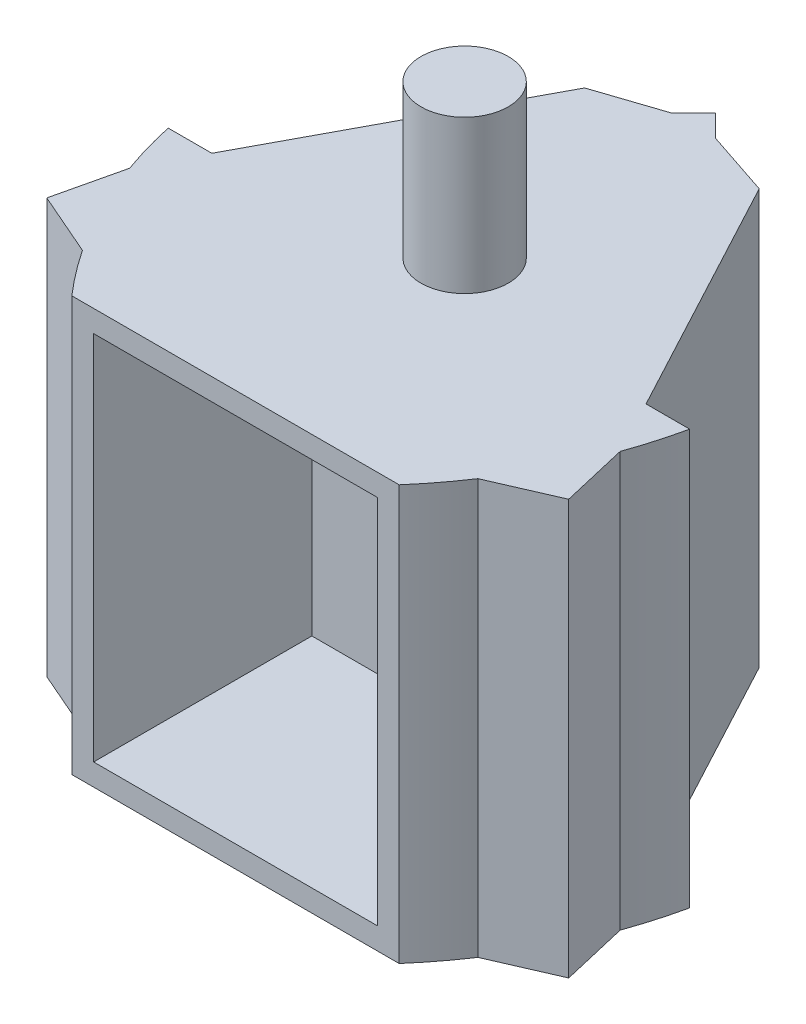
ISO-10303-21;
HEADER;
FILE_DESCRIPTION(('STEP AP214'),'2;1');
FILE_NAME('part.step','',(''),(''),'','','');
FILE_SCHEMA(('AUTOMOTIVE_DESIGN { 1 0 10303 214 1 1 1 1 }'));
ENDSEC;
DATA;
#1=APPLICATION_CONTEXT('core data for automotive mechanical design processes');
#2=APPLICATION_PROTOCOL_DEFINITION('international standard','automotive_design',2000,#1);
#3=PRODUCT_CONTEXT('',#1,'mechanical');
#4=PRODUCT('Part','Part','',(#3));
#5=PRODUCT_RELATED_PRODUCT_CATEGORY('part','',(#4));
#6=PRODUCT_DEFINITION_FORMATION('','',#4);
#7=PRODUCT_DEFINITION_CONTEXT('part definition',#1,'design');
#8=PRODUCT_DEFINITION('design','',#6,#7);
#9=PRODUCT_DEFINITION_SHAPE('','',#8);
#10=(LENGTH_UNIT() NAMED_UNIT(*) SI_UNIT(.MILLI.,.METRE.));
#11=(NAMED_UNIT(*) PLANE_ANGLE_UNIT() SI_UNIT($,.RADIAN.));
#12=(NAMED_UNIT(*) SI_UNIT($,.STERADIAN.) SOLID_ANGLE_UNIT());
#13=UNCERTAINTY_MEASURE_WITH_UNIT(LENGTH_MEASURE(1.E-05),#10,'distance_accuracy_value','');
#14=(GEOMETRIC_REPRESENTATION_CONTEXT(3) GLOBAL_UNCERTAINTY_ASSIGNED_CONTEXT((#13)) GLOBAL_UNIT_ASSIGNED_CONTEXT((#10,
#11,#12)) REPRESENTATION_CONTEXT('',''));
#15=CARTESIAN_POINT('',(0.,0.,0.));
#16=DIRECTION('',(0.,0.,1.));
#17=DIRECTION('',(1.,0.,0.));
#18=AXIS2_PLACEMENT_3D('',#15,#16,#17);
#19=CARTESIAN_POINT('',(-11.0697847980685,19.,12.8860125419096));
#20=DIRECTION('',(-0.973745378908467,0.,-0.227639928515201));
#21=DIRECTION('',(-0.227639928515201,0.,0.973745378908467));
#22=AXIS2_PLACEMENT_3D('',#19,#20,#21);
#23=PLANE('',#22);
#24=DIRECTION('',(0.227639928515201,0.,-0.973745378908467));
#25=VECTOR('',#24,1.);
#26=CARTESIAN_POINT('',(-11.0697847980685,19.,12.8860125419096));
#27=LINE('',#26,#25);
#28=CARTESIAN_POINT('',(-11.9587471370231,19.,16.6886098069273));
#29=VERTEX_POINT('',#28);
#30=CARTESIAN_POINT('',(-11.239303028901,19.,13.6111383798529));
#31=VERTEX_POINT('',#30);
#32=EDGE_CURVE('E246',#29,#31,#27,.T.);
#33=ORIENTED_EDGE('',*,*,#32,.T.);
#34=DIRECTION('',(0.,-1.,0.));
#35=VECTOR('',#34,1.);
#36=CARTESIAN_POINT('',(-11.239303028901,19.,13.6111383798529));
#37=LINE('',#36,#35);
#38=CARTESIAN_POINT('',(-11.239303028901,0.,13.6111383798529));
#39=VERTEX_POINT('',#38);
#40=EDGE_CURVE('E219',#31,#39,#37,.T.);
#41=ORIENTED_EDGE('',*,*,#40,.T.);
#42=DIRECTION('',(0.227639928515201,0.,-0.973745378908467));
#43=VECTOR('',#42,1.);
#44=CARTESIAN_POINT('',(-11.0697847980685,0.,12.8860125419096));
#45=LINE('',#44,#43);
#46=CARTESIAN_POINT('',(-11.9587471370231,0.,16.6886098069273));
#47=VERTEX_POINT('',#46);
#48=EDGE_CURVE('E247',#47,#39,#45,.T.);
#49=ORIENTED_EDGE('',*,*,#48,.F.);
#50=DIRECTION('',(0.,-1.,0.));
#51=VECTOR('',#50,1.);
#52=CARTESIAN_POINT('',(-11.9587471370231,19.,16.6886098069273));
#53=LINE('',#52,#51);
#54=EDGE_CURVE('E250',#29,#47,#53,.T.);
#55=ORIENTED_EDGE('',*,*,#54,.F.);
#56=EDGE_LOOP('',(#33,#41,#49,#55));
#57=FACE_BOUND('',#56,.T.);
#58=ADVANCED_FACE('F35',(#57),#23,.T.);
#59=CARTESIAN_POINT('',(-11.9587471370231,19.,16.6886098069273));
#60=DIRECTION('',(-0.399501555391885,0.,0.916732516735097));
#61=DIRECTION('',(0.916732516735097,0.,0.399501555391886));
#62=AXIS2_PLACEMENT_3D('',#59,#60,#61);
#63=PLANE('',#62);
#64=DIRECTION('',(-0.916732516735097,0.,-0.399501555391886));
#65=VECTOR('',#64,1.);
#66=CARTESIAN_POINT('',(-11.9587471370231,0.,16.6886098069273));
#67=LINE('',#66,#65);
#68=CARTESIAN_POINT('',(-9.06146188398829,0.,17.9512136132411));
#69=VERTEX_POINT('',#68);
#70=EDGE_CURVE('E243',#69,#47,#67,.T.);
#71=ORIENTED_EDGE('',*,*,#70,.F.);
#72=DIRECTION('',(0.,-1.,0.));
#73=VECTOR('',#72,1.);
#74=CARTESIAN_POINT('',(-9.06146188398829,19.,17.9512136132411));
#75=LINE('',#74,#73);
#76=CARTESIAN_POINT('',(-9.06146188398829,19.,17.9512136132411));
#77=VERTEX_POINT('',#76);
#78=EDGE_CURVE('E225',#77,#69,#75,.T.);
#79=ORIENTED_EDGE('',*,*,#78,.F.);
#80=DIRECTION('',(-0.916732516735097,0.,-0.399501555391886));
#81=VECTOR('',#80,1.);
#82=CARTESIAN_POINT('',(-11.9587471370231,19.,16.6886098069273));
#83=LINE('',#82,#81);
#84=EDGE_CURVE('E244',#77,#29,#83,.T.);
#85=ORIENTED_EDGE('',*,*,#84,.T.);
#86=ORIENTED_EDGE('',*,*,#54,.T.);
#87=EDGE_LOOP('',(#71,#79,#85,#86));
#88=FACE_BOUND('',#87,.T.);
#89=ADVANCED_FACE('F398',(#88),#63,.T.);
#90=CARTESIAN_POINT('',(0.,19.,11.1347257955987));
#91=DIRECTION('',(0.,0.,-1.));
#92=DIRECTION('',(-1.,0.,0.));
#93=AXIS2_PLACEMENT_3D('',#90,#91,#92);
#94=PLANE('',#93);
#95=DIRECTION('',(0.,-1.,0.));
#96=VECTOR('',#95,1.);
#97=CARTESIAN_POINT('',(9.94857701422973,19.,11.1347257955987));
#98=LINE('',#97,#96);
#99=CARTESIAN_POINT('',(9.94857701422973,19.,11.1347257955987));
#100=VERTEX_POINT('',#99);
#101=CARTESIAN_POINT('',(9.94857701422973,0.,11.1347257955987));
#102=VERTEX_POINT('',#101);
#103=EDGE_CURVE('E314',#100,#102,#98,.T.);
#104=ORIENTED_EDGE('',*,*,#103,.F.);
#105=DIRECTION('',(1.,0.,0.));
#106=VECTOR('',#105,1.);
#107=CARTESIAN_POINT('',(0.,19.,11.1347257955987));
#108=LINE('',#107,#106);
#109=CARTESIAN_POINT('',(11.9485770142297,19.,11.1347257955987));
#110=VERTEX_POINT('',#109);
#111=EDGE_CURVE('E328',#100,#110,#108,.T.);
#112=ORIENTED_EDGE('',*,*,#111,.T.);
#113=DIRECTION('',(0.,-1.,0.));
#114=VECTOR('',#113,1.);
#115=CARTESIAN_POINT('',(11.9485770142297,19.,11.1347257955987));
#116=LINE('',#115,#114);
#117=CARTESIAN_POINT('',(11.9485770142297,0.,11.1347257955987));
#118=VERTEX_POINT('',#117);
#119=EDGE_CURVE('E299',#110,#118,#116,.T.);
#120=ORIENTED_EDGE('',*,*,#119,.T.);
#121=DIRECTION('',(1.,0.,0.));
#122=VECTOR('',#121,1.);
#123=CARTESIAN_POINT('',(0.,0.,11.1347257955987));
#124=LINE('',#123,#122);
#125=EDGE_CURVE('E325',#102,#118,#124,.T.);
#126=ORIENTED_EDGE('',*,*,#125,.F.);
#127=EDGE_LOOP('',(#104,#112,#120,#126));
#128=FACE_BOUND('',#127,.T.);
#129=ADVANCED_FACE('F37',(#128),#94,.T.);
#130=CARTESIAN_POINT('',(0.,19.,11.1347257955987));
#131=DIRECTION('',(0.,0.,1.));
#132=DIRECTION('',(1.,0.,0.));
#133=AXIS2_PLACEMENT_3D('',#130,#131,#132);
#134=PLANE('',#133);
#135=DIRECTION('',(-1.,0.,0.));
#136=VECTOR('',#135,1.);
#137=CARTESIAN_POINT('',(0.,19.,11.1347257955987));
#138=LINE('',#137,#136);
#139=CARTESIAN_POINT('',(-9.94857701422979,19.,11.1347257955987));
#140=VERTEX_POINT('',#139);
#141=CARTESIAN_POINT('',(-11.9485770142298,19.,11.1347257955987));
#142=VERTEX_POINT('',#141);
#143=EDGE_CURVE('E331',#140,#142,#138,.T.);
#144=ORIENTED_EDGE('',*,*,#143,.F.);
#145=DIRECTION('',(0.,-1.,0.));
#146=VECTOR('',#145,1.);
#147=CARTESIAN_POINT('',(-9.94857701422979,19.,11.1347257955987));
#148=LINE('',#147,#146);
#149=CARTESIAN_POINT('',(-9.94857701422979,0.,11.1347257955987));
#150=VERTEX_POINT('',#149);
#151=EDGE_CURVE('E306',#140,#150,#148,.T.);
#152=ORIENTED_EDGE('',*,*,#151,.T.);
#153=DIRECTION('',(-1.,0.,0.));
#154=VECTOR('',#153,1.);
#155=CARTESIAN_POINT('',(0.,0.,11.1347257955987));
#156=LINE('',#155,#154);
#157=CARTESIAN_POINT('',(-11.9485770142298,0.,11.1347257955987));
#158=VERTEX_POINT('',#157);
#159=EDGE_CURVE('E341',#150,#158,#156,.T.);
#160=ORIENTED_EDGE('',*,*,#159,.T.);
#161=DIRECTION('',(0.,-1.,0.));
#162=VECTOR('',#161,1.);
#163=CARTESIAN_POINT('',(-11.9485770142298,19.,11.1347257955987));
#164=LINE('',#163,#162);
#165=EDGE_CURVE('E297',#142,#158,#164,.T.);
#166=ORIENTED_EDGE('',*,*,#165,.F.);
#167=EDGE_LOOP('',(#144,#152,#160,#166));
#168=FACE_BOUND('',#167,.T.);
#169=ADVANCED_FACE('F408',(#168),#134,.F.);
#170=CARTESIAN_POINT('',(0.,19.,20.));
#171=DIRECTION('',(0.,0.,-1.));
#172=DIRECTION('',(-1.,0.,0.));
#173=AXIS2_PLACEMENT_3D('',#170,#171,#172);
#174=PLANE('',#173);
#175=DIRECTION('',(1.,0.,0.));
#176=VECTOR('',#175,1.);
#177=CARTESIAN_POINT('',(-6.50000000000006,1.,20.));
#178=LINE('',#177,#176);
#179=CARTESIAN_POINT('',(-6.50000000000006,1.,20.));
#180=VERTEX_POINT('',#179);
#181=CARTESIAN_POINT('',(6.49999999999995,1.,20.));
#182=VERTEX_POINT('',#181);
#183=EDGE_CURVE('E207',#180,#182,#178,.T.);
#184=ORIENTED_EDGE('',*,*,#183,.F.);
#185=DIRECTION('',(0.,-1.,0.));
#186=VECTOR('',#185,1.);
#187=CARTESIAN_POINT('',(-6.50000000000006,18.,20.));
#188=LINE('',#187,#186);
#189=CARTESIAN_POINT('',(-6.50000000000006,18.,20.));
#190=VERTEX_POINT('',#189);
#191=EDGE_CURVE('E50',#190,#180,#188,.T.);
#192=ORIENTED_EDGE('',*,*,#191,.F.);
#193=DIRECTION('',(-1.,0.,0.));
#194=VECTOR('',#193,1.);
#195=CARTESIAN_POINT('',(-6.50000000000006,18.,20.));
#196=LINE('',#195,#194);
#197=CARTESIAN_POINT('',(6.49999999999995,18.,20.));
#198=VERTEX_POINT('',#197);
#199=EDGE_CURVE('E198',#198,#190,#196,.T.);
#200=ORIENTED_EDGE('',*,*,#199,.F.);
#201=DIRECTION('',(0.,1.,0.));
#202=VECTOR('',#201,1.);
#203=CARTESIAN_POINT('',(6.49999999999995,18.,20.));
#204=LINE('',#203,#202);
#205=EDGE_CURVE('E201',#182,#198,#204,.T.);
#206=ORIENTED_EDGE('',*,*,#205,.F.);
#207=EDGE_LOOP('',(#184,#192,#200,#206));
#208=FACE_BOUND('',#207,.T.);
#209=DIRECTION('',(1.,0.,0.));
#210=VECTOR('',#209,1.);
#211=CARTESIAN_POINT('',(0.,0.,20.));
#212=LINE('',#211,#210);
#213=CARTESIAN_POINT('',(-7.50000000000006,0.,20.));
#214=VERTEX_POINT('',#213);
#215=CARTESIAN_POINT('',(7.49999999999995,0.,20.));
#216=VERTEX_POINT('',#215);
#217=EDGE_CURVE('E332',#214,#216,#212,.T.);
#218=ORIENTED_EDGE('',*,*,#217,.T.);
#219=DIRECTION('',(0.,-1.,0.));
#220=VECTOR('',#219,1.);
#221=CARTESIAN_POINT('',(7.49999999999995,19.,20.));
#222=LINE('',#221,#220);
#223=CARTESIAN_POINT('',(7.49999999999995,19.,20.));
#224=VERTEX_POINT('',#223);
#225=EDGE_CURVE('E338',#224,#216,#222,.T.);
#226=ORIENTED_EDGE('',*,*,#225,.F.);
#227=DIRECTION('',(1.,0.,0.));
#228=VECTOR('',#227,1.);
#229=CARTESIAN_POINT('',(0.,19.,20.));
#230=LINE('',#229,#228);
#231=CARTESIAN_POINT('',(-7.50000000000006,19.,20.));
#232=VERTEX_POINT('',#231);
#233=EDGE_CURVE('E335',#232,#224,#230,.T.);
#234=ORIENTED_EDGE('',*,*,#233,.F.);
#235=DIRECTION('',(0.,-1.,0.));
#236=VECTOR('',#235,1.);
#237=CARTESIAN_POINT('',(-7.50000000000005,19.,20.));
#238=LINE('',#237,#236);
#239=EDGE_CURVE('E347',#232,#214,#238,.T.);
#240=ORIENTED_EDGE('',*,*,#239,.T.);
#241=EDGE_LOOP('',(#218,#226,#234,#240));
#242=FACE_BOUND('',#241,.T.);
#243=ADVANCED_FACE('F392',(#208,#242),#174,.F.);
#244=CARTESIAN_POINT('',(0.,19.,0.));
#245=DIRECTION('',(0.,1.,0.));
#246=DIRECTION('',(0.,0.,1.));
#247=AXIS2_PLACEMENT_3D('',#244,#245,#246);
#248=PLANE('',#247);
#249=ORIENTED_EDGE('',*,*,#143,.T.);
#250=CARTESIAN_POINT('',(7.59308057486575,19.,6.87754143612533));
#251=DIRECTION('',(0.,-1.,0.));
#252=DIRECTION('',(0.,0.,-1.));
#253=AXIS2_PLACEMENT_3D('',#250,#251,#252);
#254=CIRCLE('',#253,20.);
#255=EDGE_CURVE('E217',#142,#31,#254,.F.);
#256=ORIENTED_EDGE('',*,*,#255,.T.);
#257=ORIENTED_EDGE('',*,*,#32,.F.);
#258=ORIENTED_EDGE('',*,*,#84,.F.);
#259=CARTESIAN_POINT('',(7.59308057486575,19.,6.87754143612533));
#260=DIRECTION('',(0.,-1.,0.));
#261=DIRECTION('',(0.,0.,-1.));
#262=AXIS2_PLACEMENT_3D('',#259,#260,#261);
#263=CIRCLE('',#262,20.);
#264=EDGE_CURVE('E223',#77,#232,#263,.F.);
#265=ORIENTED_EDGE('',*,*,#264,.T.);
#266=ORIENTED_EDGE('',*,*,#233,.T.);
#267=CARTESIAN_POINT('',(-7.5930805748658,19.,6.87754143612525));
#268=DIRECTION('',(0.,-1.,0.));
#269=DIRECTION('',(0.,0.,-1.));
#270=AXIS2_PLACEMENT_3D('',#267,#268,#269);
#271=CIRCLE('',#270,20.);
#272=CARTESIAN_POINT('',(9.06146188398819,19.,17.9512136132411));
#273=VERTEX_POINT('',#272);
#274=EDGE_CURVE('E229',#273,#224,#271,.T.);
#275=ORIENTED_EDGE('',*,*,#274,.F.);
#276=DIRECTION('',(-0.916732516735097,0.,0.399501555391886));
#277=VECTOR('',#276,1.);
#278=CARTESIAN_POINT('',(11.958747137023,19.,16.6886098069273));
#279=LINE('',#278,#277);
#280=CARTESIAN_POINT('',(11.958747137023,19.,16.6886098069273));
#281=VERTEX_POINT('',#280);
#282=EDGE_CURVE('E259',#281,#273,#279,.T.);
#283=ORIENTED_EDGE('',*,*,#282,.F.);
#284=DIRECTION('',(0.227639928515193,0.,0.973745378908469));
#285=VECTOR('',#284,1.);
#286=CARTESIAN_POINT('',(11.0697847980684,19.,12.8860125419096));
#287=LINE('',#286,#285);
#288=CARTESIAN_POINT('',(11.2393030289009,19.,13.6111383798529));
#289=VERTEX_POINT('',#288);
#290=EDGE_CURVE('E257',#289,#281,#287,.T.);
#291=ORIENTED_EDGE('',*,*,#290,.F.);
#292=CARTESIAN_POINT('',(-7.5930805748658,19.,6.87754143612525));
#293=DIRECTION('',(0.,-1.,0.));
#294=DIRECTION('',(0.,0.,-1.));
#295=AXIS2_PLACEMENT_3D('',#292,#293,#294);
#296=CIRCLE('',#295,20.);
#297=EDGE_CURVE('E237',#110,#289,#296,.T.);
#298=ORIENTED_EDGE('',*,*,#297,.F.);
#299=ORIENTED_EDGE('',*,*,#111,.F.);
#300=DIRECTION('',(0.471208324068974,0.,0.882021947191854));
#301=VECTOR('',#300,1.);
#302=CARTESIAN_POINT('',(9.94857701422973,19.,11.1347257955987));
#303=LINE('',#302,#301);
#304=CARTESIAN_POINT('',(4.,19.,0.));
#305=VERTEX_POINT('',#304);
#306=EDGE_CURVE('E312',#305,#100,#303,.T.);
#307=ORIENTED_EDGE('',*,*,#306,.F.);
#308=DIRECTION('',(0.948683298050514,0.,0.316227766016838));
#309=VECTOR('',#308,1.);
#310=CARTESIAN_POINT('',(1.,19.,-1.));
#311=LINE('',#310,#309);
#312=CARTESIAN_POINT('',(1.,19.,-1.));
#313=VERTEX_POINT('',#312);
#314=EDGE_CURVE('E270',#313,#305,#311,.T.);
#315=ORIENTED_EDGE('',*,*,#314,.F.);
#316=DIRECTION('',(0.707106781186548,0.,0.707106781186548));
#317=VECTOR('',#316,1.);
#318=CARTESIAN_POINT('',(2.,19.,0.));
#319=LINE('',#318,#317);
#320=CARTESIAN_POINT('',(0.,19.,-2.));
#321=VERTEX_POINT('',#320);
#322=EDGE_CURVE('E287',#321,#313,#319,.T.);
#323=ORIENTED_EDGE('',*,*,#322,.F.);
#324=DIRECTION('',(0.707106781186548,0.,-0.707106781186548));
#325=VECTOR('',#324,1.);
#326=CARTESIAN_POINT('',(0.,19.,-2.));
#327=LINE('',#326,#325);
#328=CARTESIAN_POINT('',(-1.,19.,-1.));
#329=VERTEX_POINT('',#328);
#330=EDGE_CURVE('E285',#329,#321,#327,.T.);
#331=ORIENTED_EDGE('',*,*,#330,.F.);
#332=DIRECTION('',(0.948683298050514,0.,-0.316227766016838));
#333=VECTOR('',#332,1.);
#334=CARTESIAN_POINT('',(-1.,19.,-1.));
#335=LINE('',#334,#333);
#336=CARTESIAN_POINT('',(-4.,19.,0.));
#337=VERTEX_POINT('',#336);
#338=EDGE_CURVE('E278',#337,#329,#335,.T.);
#339=ORIENTED_EDGE('',*,*,#338,.F.);
#340=DIRECTION('',(0.471208324068977,0.,-0.882021947191852));
#341=VECTOR('',#340,1.);
#342=CARTESIAN_POINT('',(-9.94857701422979,19.,11.1347257955987));
#343=LINE('',#342,#341);
#344=EDGE_CURVE('E303',#140,#337,#343,.T.);
#345=ORIENTED_EDGE('',*,*,#344,.F.);
#346=EDGE_LOOP('',(#249,#256,#257,#258,#265,#266,#275,#283,#291,#298,#299,#307,#315,#323,#331,
#339,#345));
#347=FACE_BOUND('',#346,.T.);
#348=CARTESIAN_POINT('',(0.,19.,9.50000000000001));
#349=DIRECTION('',(0.,1.,0.));
#350=DIRECTION('',(0.,0.,1.));
#351=AXIS2_PLACEMENT_3D('',#348,#349,#350);
#352=CIRCLE('',#351,2.);
#353=CARTESIAN_POINT('',(0.,19.,11.5));
#354=VERTEX_POINT('',#353);
#355=EDGE_CURVE('E321',#354,#354,#352,.T.);
#356=ORIENTED_EDGE('',*,*,#355,.F.);
#357=EDGE_LOOP('',(#356));
#358=FACE_BOUND('',#357,.T.);
#359=ADVANCED_FACE('F370',(#347,#358),#248,.T.);
#360=CARTESIAN_POINT('',(0.,0.,0.));
#361=DIRECTION('',(0.,1.,0.));
#362=DIRECTION('',(0.,0.,1.));
#363=AXIS2_PLACEMENT_3D('',#360,#361,#362);
#364=PLANE('',#363);
#365=CARTESIAN_POINT('',(7.59308057486575,0.,6.87754143612533));
#366=DIRECTION('',(0.,-1.,0.));
#367=DIRECTION('',(0.,0.,-1.));
#368=AXIS2_PLACEMENT_3D('',#365,#366,#367);
#369=CIRCLE('',#368,20.);
#370=EDGE_CURVE('E213',#158,#39,#369,.F.);
#371=ORIENTED_EDGE('',*,*,#370,.F.);
#372=ORIENTED_EDGE('',*,*,#159,.F.);
#373=DIRECTION('',(0.471208324068977,0.,-0.882021947191852));
#374=VECTOR('',#373,1.);
#375=CARTESIAN_POINT('',(-9.94857701422979,0.,11.1347257955987));
#376=LINE('',#375,#374);
#377=CARTESIAN_POINT('',(-4.,0.,0.));
#378=VERTEX_POINT('',#377);
#379=EDGE_CURVE('E302',#150,#378,#376,.T.);
#380=ORIENTED_EDGE('',*,*,#379,.T.);
#381=DIRECTION('',(0.948683298050514,0.,-0.316227766016838));
#382=VECTOR('',#381,1.);
#383=CARTESIAN_POINT('',(-1.,0.,-1.));
#384=LINE('',#383,#382);
#385=CARTESIAN_POINT('',(-1.,0.,-1.));
#386=VERTEX_POINT('',#385);
#387=EDGE_CURVE('E277',#378,#386,#384,.T.);
#388=ORIENTED_EDGE('',*,*,#387,.T.);
#389=DIRECTION('',(0.707106781186548,0.,-0.707106781186548));
#390=VECTOR('',#389,1.);
#391=CARTESIAN_POINT('',(0.,0.,-2.));
#392=LINE('',#391,#390);
#393=CARTESIAN_POINT('',(0.,0.,-2.));
#394=VERTEX_POINT('',#393);
#395=EDGE_CURVE('E284',#386,#394,#392,.T.);
#396=ORIENTED_EDGE('',*,*,#395,.T.);
#397=DIRECTION('',(0.707106781186548,0.,0.707106781186548));
#398=VECTOR('',#397,1.);
#399=CARTESIAN_POINT('',(2.,0.,0.));
#400=LINE('',#399,#398);
#401=CARTESIAN_POINT('',(1.,0.,-1.));
#402=VERTEX_POINT('',#401);
#403=EDGE_CURVE('E288',#394,#402,#400,.T.);
#404=ORIENTED_EDGE('',*,*,#403,.T.);
#405=DIRECTION('',(0.948683298050514,0.,0.316227766016838));
#406=VECTOR('',#405,1.);
#407=CARTESIAN_POINT('',(1.,0.,-1.));
#408=LINE('',#407,#406);
#409=CARTESIAN_POINT('',(4.,0.,0.));
#410=VERTEX_POINT('',#409);
#411=EDGE_CURVE('E269',#402,#410,#408,.T.);
#412=ORIENTED_EDGE('',*,*,#411,.T.);
#413=DIRECTION('',(0.471208324068974,0.,0.882021947191854));
#414=VECTOR('',#413,1.);
#415=CARTESIAN_POINT('',(9.94857701422973,0.,11.1347257955987));
#416=LINE('',#415,#414);
#417=EDGE_CURVE('E311',#410,#102,#416,.T.);
#418=ORIENTED_EDGE('',*,*,#417,.T.);
#419=ORIENTED_EDGE('',*,*,#125,.T.);
#420=CARTESIAN_POINT('',(-7.5930805748658,0.,6.87754143612525));
#421=DIRECTION('',(0.,-1.,0.));
#422=DIRECTION('',(0.,0.,-1.));
#423=AXIS2_PLACEMENT_3D('',#420,#421,#422);
#424=CIRCLE('',#423,20.);
#425=CARTESIAN_POINT('',(11.2393030289009,0.,13.6111383798529));
#426=VERTEX_POINT('',#425);
#427=EDGE_CURVE('E236',#118,#426,#424,.T.);
#428=ORIENTED_EDGE('',*,*,#427,.T.);
#429=DIRECTION('',(0.227639928515193,0.,0.973745378908469));
#430=VECTOR('',#429,1.);
#431=CARTESIAN_POINT('',(11.0697847980684,0.,12.8860125419096));
#432=LINE('',#431,#430);
#433=CARTESIAN_POINT('',(11.958747137023,0.,16.6886098069273));
#434=VERTEX_POINT('',#433);
#435=EDGE_CURVE('E256',#426,#434,#432,.T.);
#436=ORIENTED_EDGE('',*,*,#435,.T.);
#437=DIRECTION('',(-0.916732516735097,0.,0.399501555391886));
#438=VECTOR('',#437,1.);
#439=CARTESIAN_POINT('',(11.958747137023,0.,16.6886098069273));
#440=LINE('',#439,#438);
#441=CARTESIAN_POINT('',(9.06146188398819,0.,17.9512136132411));
#442=VERTEX_POINT('',#441);
#443=EDGE_CURVE('E260',#434,#442,#440,.T.);
#444=ORIENTED_EDGE('',*,*,#443,.T.);
#445=CARTESIAN_POINT('',(-7.5930805748658,0.,6.87754143612525));
#446=DIRECTION('',(0.,-1.,0.));
#447=DIRECTION('',(0.,0.,-1.));
#448=AXIS2_PLACEMENT_3D('',#445,#446,#447);
#449=CIRCLE('',#448,20.);
#450=EDGE_CURVE('E228',#442,#216,#449,.T.);
#451=ORIENTED_EDGE('',*,*,#450,.T.);
#452=ORIENTED_EDGE('',*,*,#217,.F.);
#453=CARTESIAN_POINT('',(7.59308057486575,0.,6.87754143612533));
#454=DIRECTION('',(0.,-1.,0.));
#455=DIRECTION('',(0.,0.,-1.));
#456=AXIS2_PLACEMENT_3D('',#453,#454,#455);
#457=CIRCLE('',#456,20.);
#458=EDGE_CURVE('E58',#69,#214,#457,.F.);
#459=ORIENTED_EDGE('',*,*,#458,.F.);
#460=ORIENTED_EDGE('',*,*,#70,.T.);
#461=ORIENTED_EDGE('',*,*,#48,.T.);
#462=EDGE_LOOP('',(#371,#372,#380,#388,#396,#404,#412,#418,#419,#428,#436,#444,#451,#452,#459,
#460,#461));
#463=FACE_BOUND('',#462,.T.);
#464=CARTESIAN_POINT('',(0.,0.,9.50000000000001));
#465=DIRECTION('',(0.,1.,0.));
#466=DIRECTION('',(0.,0.,1.));
#467=AXIS2_PLACEMENT_3D('',#464,#465,#466);
#468=CIRCLE('',#467,2.);
#469=CARTESIAN_POINT('',(0.,0.,11.5));
#470=VERTEX_POINT('',#469);
#471=EDGE_CURVE('E11',#470,#470,#468,.F.);
#472=ORIENTED_EDGE('',*,*,#471,.F.);
#473=EDGE_LOOP('',(#472));
#474=FACE_BOUND('',#473,.T.);
#475=ADVANCED_FACE('F360',(#463,#474),#364,.F.);
#476=CARTESIAN_POINT('',(0.,26.,9.50000000000001));
#477=DIRECTION('',(0.,-1.,0.));
#478=DIRECTION('',(0.,0.,-1.));
#479=AXIS2_PLACEMENT_3D('',#476,#477,#478);
#480=CYLINDRICAL_SURFACE('',#479,2.);
#481=CARTESIAN_POINT('',(0.,26.,9.50000000000001));
#482=DIRECTION('',(0.,1.,0.));
#483=DIRECTION('',(0.,0.,1.));
#484=AXIS2_PLACEMENT_3D('',#481,#482,#483);
#485=CIRCLE('',#484,2.);
#486=CARTESIAN_POINT('',(0.,26.,11.5));
#487=VERTEX_POINT('',#486);
#488=EDGE_CURVE('E322',#487,#487,#485,.T.);
#489=ORIENTED_EDGE('',*,*,#488,.F.);
#490=EDGE_LOOP('',(#489));
#491=FACE_BOUND('',#490,.T.);
#492=ORIENTED_EDGE('',*,*,#355,.T.);
#493=EDGE_LOOP('',(#492));
#494=FACE_BOUND('',#493,.T.);
#495=ADVANCED_FACE('F549',(#491,#494),#480,.T.);
#496=CARTESIAN_POINT('',(0.,26.,0.));
#497=DIRECTION('',(0.,1.,0.));
#498=DIRECTION('',(0.,0.,1.));
#499=AXIS2_PLACEMENT_3D('',#496,#497,#498);
#500=PLANE('',#499);
#501=ORIENTED_EDGE('',*,*,#488,.T.);
#502=EDGE_LOOP('',(#501));
#503=FACE_BOUND('',#502,.T.);
#504=ADVANCED_FACE('F688',(#503),#500,.T.);
#505=CARTESIAN_POINT('',(0.,-7.,9.50000000000001));
#506=DIRECTION('',(0.,1.,0.));
#507=DIRECTION('',(0.,0.,1.));
#508=AXIS2_PLACEMENT_3D('',#505,#506,#507);
#509=CYLINDRICAL_SURFACE('',#508,2.);
#510=CARTESIAN_POINT('',(0.,-7.,9.50000000000001));
#511=DIRECTION('',(0.,-1.,0.));
#512=DIRECTION('',(0.,0.,-1.));
#513=AXIS2_PLACEMENT_3D('',#510,#511,#512);
#514=CIRCLE('',#513,2.);
#515=CARTESIAN_POINT('',(0.,-7.,7.50000000000001));
#516=VERTEX_POINT('',#515);
#517=EDGE_CURVE('E318',#516,#516,#514,.T.);
#518=ORIENTED_EDGE('',*,*,#517,.F.);
#519=EDGE_LOOP('',(#518));
#520=FACE_BOUND('',#519,.T.);
#521=ORIENTED_EDGE('',*,*,#471,.T.);
#522=EDGE_LOOP('',(#521));
#523=FACE_BOUND('',#522,.T.);
#524=ADVANCED_FACE('F676',(#520,#523),#509,.T.);
#525=CARTESIAN_POINT('',(0.,-7.,0.));
#526=DIRECTION('',(0.,-1.,0.));
#527=DIRECTION('',(0.,0.,-1.));
#528=AXIS2_PLACEMENT_3D('',#525,#526,#527);
#529=PLANE('',#528);
#530=ORIENTED_EDGE('',*,*,#517,.T.);
#531=EDGE_LOOP('',(#530));
#532=FACE_BOUND('',#531,.T.);
#533=ADVANCED_FACE('F666',(#532),#529,.T.);
#534=CARTESIAN_POINT('',(9.94857701422973,19.,11.1347257955987));
#535=DIRECTION('',(0.882021947191854,0.,-0.471208324068974));
#536=DIRECTION('',(-0.471208324068974,0.,-0.882021947191854));
#537=AXIS2_PLACEMENT_3D('',#534,#535,#536);
#538=PLANE('',#537);
#539=ORIENTED_EDGE('',*,*,#417,.F.);
#540=DIRECTION('',(0.,-1.,0.));
#541=VECTOR('',#540,1.);
#542=CARTESIAN_POINT('',(4.,19.,0.));
#543=LINE('',#542,#541);
#544=EDGE_CURVE('E43',#305,#410,#543,.T.);
#545=ORIENTED_EDGE('',*,*,#544,.F.);
#546=ORIENTED_EDGE('',*,*,#306,.T.);
#547=ORIENTED_EDGE('',*,*,#103,.T.);
#548=EDGE_LOOP('',(#539,#545,#546,#547));
#549=FACE_BOUND('',#548,.T.);
#550=ADVANCED_FACE('F364',(#549),#538,.T.);
#551=CARTESIAN_POINT('',(-9.94857701422979,19.,11.1347257955987));
#552=DIRECTION('',(-0.882021947191852,0.,-0.471208324068977));
#553=DIRECTION('',(-0.471208324068977,0.,0.882021947191852));
#554=AXIS2_PLACEMENT_3D('',#551,#552,#553);
#555=PLANE('',#554);
#556=ORIENTED_EDGE('',*,*,#379,.F.);
#557=ORIENTED_EDGE('',*,*,#151,.F.);
#558=ORIENTED_EDGE('',*,*,#344,.T.);
#559=DIRECTION('',(0.,-1.,0.));
#560=VECTOR('',#559,1.);
#561=CARTESIAN_POINT('',(-4.,19.,0.));
#562=LINE('',#561,#560);
#563=EDGE_CURVE('E350',#337,#378,#562,.T.);
#564=ORIENTED_EDGE('',*,*,#563,.T.);
#565=EDGE_LOOP('',(#556,#557,#558,#564));
#566=FACE_BOUND('',#565,.T.);
#567=ADVANCED_FACE('F412',(#566),#555,.T.);
#568=CARTESIAN_POINT('',(2.,19.,0.));
#569=DIRECTION('',(0.707106781186548,0.,-0.707106781186548));
#570=DIRECTION('',(-0.707106781186548,0.,-0.707106781186548));
#571=AXIS2_PLACEMENT_3D('',#568,#569,#570);
#572=PLANE('',#571);
#573=DIRECTION('',(0.,-1.,0.));
#574=VECTOR('',#573,1.);
#575=CARTESIAN_POINT('',(1.,19.,-1.));
#576=LINE('',#575,#574);
#577=EDGE_CURVE('E272',#313,#402,#576,.T.);
#578=ORIENTED_EDGE('',*,*,#577,.T.);
#579=ORIENTED_EDGE('',*,*,#403,.F.);
#580=DIRECTION('',(0.,-1.,0.));
#581=VECTOR('',#580,1.);
#582=CARTESIAN_POINT('',(0.,19.,-2.));
#583=LINE('',#582,#581);
#584=EDGE_CURVE('E291',#321,#394,#583,.T.);
#585=ORIENTED_EDGE('',*,*,#584,.F.);
#586=ORIENTED_EDGE('',*,*,#322,.T.);
#587=EDGE_LOOP('',(#578,#579,#585,#586));
#588=FACE_BOUND('',#587,.T.);
#589=ADVANCED_FACE('F425',(#588),#572,.T.);
#590=CARTESIAN_POINT('',(0.,19.,-2.));
#591=DIRECTION('',(-0.707106781186548,0.,-0.707106781186548));
#592=DIRECTION('',(-0.707106781186548,0.,0.707106781186548));
#593=AXIS2_PLACEMENT_3D('',#590,#591,#592);
#594=PLANE('',#593);
#595=DIRECTION('',(0.,-1.,0.));
#596=VECTOR('',#595,1.);
#597=CARTESIAN_POINT('',(-1.,19.,-1.));
#598=LINE('',#597,#596);
#599=EDGE_CURVE('E280',#329,#386,#598,.T.);
#600=ORIENTED_EDGE('',*,*,#599,.F.);
#601=ORIENTED_EDGE('',*,*,#330,.T.);
#602=ORIENTED_EDGE('',*,*,#584,.T.);
#603=ORIENTED_EDGE('',*,*,#395,.F.);
#604=EDGE_LOOP('',(#600,#601,#602,#603));
#605=FACE_BOUND('',#604,.T.);
#606=ADVANCED_FACE('F422',(#605),#594,.T.);
#607=CARTESIAN_POINT('',(-1.,19.,-1.));
#608=DIRECTION('',(-0.316227766016838,0.,-0.948683298050514));
#609=DIRECTION('',(-0.948683298050514,0.,0.316227766016838));
#610=AXIS2_PLACEMENT_3D('',#607,#608,#609);
#611=PLANE('',#610);
#612=ORIENTED_EDGE('',*,*,#387,.F.);
#613=ORIENTED_EDGE('',*,*,#563,.F.);
#614=ORIENTED_EDGE('',*,*,#338,.T.);
#615=ORIENTED_EDGE('',*,*,#599,.T.);
#616=EDGE_LOOP('',(#612,#613,#614,#615));
#617=FACE_BOUND('',#616,.T.);
#618=ADVANCED_FACE('F416',(#617),#611,.T.);
#619=CARTESIAN_POINT('',(1.,19.,-1.));
#620=DIRECTION('',(0.316227766016838,0.,-0.948683298050514));
#621=DIRECTION('',(-0.948683298050514,0.,-0.316227766016838));
#622=AXIS2_PLACEMENT_3D('',#619,#620,#621);
#623=PLANE('',#622);
#624=ORIENTED_EDGE('',*,*,#411,.F.);
#625=ORIENTED_EDGE('',*,*,#577,.F.);
#626=ORIENTED_EDGE('',*,*,#314,.T.);
#627=ORIENTED_EDGE('',*,*,#544,.T.);
#628=EDGE_LOOP('',(#624,#625,#626,#627));
#629=FACE_BOUND('',#628,.T.);
#630=ADVANCED_FACE('F354',(#629),#623,.T.);
#631=CARTESIAN_POINT('',(11.958747137023,19.,16.6886098069273));
#632=DIRECTION('',(0.399501555391886,0.,0.916732516735097));
#633=DIRECTION('',(0.916732516735097,0.,-0.399501555391886));
#634=AXIS2_PLACEMENT_3D('',#631,#632,#633);
#635=PLANE('',#634);
#636=DIRECTION('',(0.,-1.,0.));
#637=VECTOR('',#636,1.);
#638=CARTESIAN_POINT('',(9.06146188398819,19.,17.9512136132411));
#639=LINE('',#638,#637);
#640=EDGE_CURVE('E231',#273,#442,#639,.T.);
#641=ORIENTED_EDGE('',*,*,#640,.T.);
#642=ORIENTED_EDGE('',*,*,#443,.F.);
#643=DIRECTION('',(0.,-1.,0.));
#644=VECTOR('',#643,1.);
#645=CARTESIAN_POINT('',(11.958747137023,19.,16.6886098069273));
#646=LINE('',#645,#644);
#647=EDGE_CURVE('E263',#281,#434,#646,.T.);
#648=ORIENTED_EDGE('',*,*,#647,.F.);
#649=ORIENTED_EDGE('',*,*,#282,.T.);
#650=EDGE_LOOP('',(#641,#642,#648,#649));
#651=FACE_BOUND('',#650,.T.);
#652=ADVANCED_FACE('F383',(#651),#635,.T.);
#653=CARTESIAN_POINT('',(11.0697847980684,19.,12.8860125419096));
#654=DIRECTION('',(0.973745378908469,0.,-0.227639928515193));
#655=DIRECTION('',(-0.227639928515193,0.,-0.973745378908469));
#656=AXIS2_PLACEMENT_3D('',#653,#654,#655);
#657=PLANE('',#656);
#658=DIRECTION('',(0.,-1.,0.));
#659=VECTOR('',#658,1.);
#660=CARTESIAN_POINT('',(11.2393030289009,19.,13.6111383798529));
#661=LINE('',#660,#659);
#662=EDGE_CURVE('E239',#289,#426,#661,.T.);
#663=ORIENTED_EDGE('',*,*,#662,.F.);
#664=ORIENTED_EDGE('',*,*,#290,.T.);
#665=ORIENTED_EDGE('',*,*,#647,.T.);
#666=ORIENTED_EDGE('',*,*,#435,.F.);
#667=EDGE_LOOP('',(#663,#664,#665,#666));
#668=FACE_BOUND('',#667,.T.);
#669=ADVANCED_FACE('F379',(#668),#657,.T.);
#670=CARTESIAN_POINT('',(-7.5930805748658,19.,6.87754143612525));
#671=DIRECTION('',(0.,-1.,0.));
#672=DIRECTION('',(0.,0.,-1.));
#673=AXIS2_PLACEMENT_3D('',#670,#671,#672);
#674=CYLINDRICAL_SURFACE('',#673,20.);
#675=ORIENTED_EDGE('',*,*,#427,.F.);
#676=ORIENTED_EDGE('',*,*,#119,.F.);
#677=ORIENTED_EDGE('',*,*,#297,.T.);
#678=ORIENTED_EDGE('',*,*,#662,.T.);
#679=EDGE_LOOP('',(#675,#676,#677,#678));
#680=FACE_BOUND('',#679,.T.);
#681=ADVANCED_FACE('F376',(#680),#674,.T.);
#682=CARTESIAN_POINT('',(-7.5930805748658,19.,6.87754143612525));
#683=DIRECTION('',(0.,-1.,0.));
#684=DIRECTION('',(0.,0.,-1.));
#685=AXIS2_PLACEMENT_3D('',#682,#683,#684);
#686=CYLINDRICAL_SURFACE('',#685,20.);
#687=ORIENTED_EDGE('',*,*,#450,.F.);
#688=ORIENTED_EDGE('',*,*,#640,.F.);
#689=ORIENTED_EDGE('',*,*,#274,.T.);
#690=ORIENTED_EDGE('',*,*,#225,.T.);
#691=EDGE_LOOP('',(#687,#688,#689,#690));
#692=FACE_BOUND('',#691,.T.);
#693=ADVANCED_FACE('F386',(#692),#686,.T.);
#694=CARTESIAN_POINT('',(7.59308057486575,19.,6.87754143612533));
#695=DIRECTION('',(0.,-1.,0.));
#696=DIRECTION('',(0.,0.,-1.));
#697=AXIS2_PLACEMENT_3D('',#694,#695,#696);
#698=CYLINDRICAL_SURFACE('',#697,20.);
#699=ORIENTED_EDGE('',*,*,#458,.T.);
#700=ORIENTED_EDGE('',*,*,#239,.F.);
#701=ORIENTED_EDGE('',*,*,#264,.F.);
#702=ORIENTED_EDGE('',*,*,#78,.T.);
#703=EDGE_LOOP('',(#699,#700,#701,#702));
#704=FACE_BOUND('',#703,.T.);
#705=ADVANCED_FACE('F394',(#704),#698,.T.);
#706=CARTESIAN_POINT('',(7.59308057486575,19.,6.87754143612533));
#707=DIRECTION('',(0.,-1.,0.));
#708=DIRECTION('',(0.,0.,-1.));
#709=AXIS2_PLACEMENT_3D('',#706,#707,#708);
#710=CYLINDRICAL_SURFACE('',#709,20.);
#711=ORIENTED_EDGE('',*,*,#370,.T.);
#712=ORIENTED_EDGE('',*,*,#40,.F.);
#713=ORIENTED_EDGE('',*,*,#255,.F.);
#714=ORIENTED_EDGE('',*,*,#165,.T.);
#715=EDGE_LOOP('',(#711,#712,#713,#714));
#716=FACE_BOUND('',#715,.T.);
#717=ADVANCED_FACE('F405',(#716),#710,.T.);
#718=CARTESIAN_POINT('',(-6.50000000000006,18.,10.));
#719=DIRECTION('',(-1.,0.,0.));
#720=DIRECTION('',(0.,0.,1.));
#721=AXIS2_PLACEMENT_3D('',#718,#719,#720);
#722=PLANE('',#721);
#723=ORIENTED_EDGE('',*,*,#191,.T.);
#724=DIRECTION('',(0.,0.,1.));
#725=VECTOR('',#724,1.);
#726=CARTESIAN_POINT('',(-6.50000000000006,1.,10.));
#727=LINE('',#726,#725);
#728=CARTESIAN_POINT('',(-6.50000000000006,1.,10.));
#729=VERTEX_POINT('',#728);
#730=EDGE_CURVE('E176',#729,#180,#727,.T.);
#731=ORIENTED_EDGE('',*,*,#730,.F.);
#732=DIRECTION('',(0.,-1.,0.));
#733=VECTOR('',#732,1.);
#734=CARTESIAN_POINT('',(-6.50000000000006,18.,10.));
#735=LINE('',#734,#733);
#736=CARTESIAN_POINT('',(-6.50000000000006,18.,10.));
#737=VERTEX_POINT('',#736);
#738=EDGE_CURVE('E180',#737,#729,#735,.T.);
#739=ORIENTED_EDGE('',*,*,#738,.F.);
#740=DIRECTION('',(0.,0.,1.));
#741=VECTOR('',#740,1.);
#742=CARTESIAN_POINT('',(-6.50000000000006,18.,10.));
#743=LINE('',#742,#741);
#744=EDGE_CURVE('E211',#737,#190,#743,.T.);
#745=ORIENTED_EDGE('',*,*,#744,.T.);
#746=EDGE_LOOP('',(#723,#731,#739,#745));
#747=FACE_BOUND('',#746,.T.);
#748=ADVANCED_FACE('F178',(#747),#722,.F.);
#749=CARTESIAN_POINT('',(-6.50000000000006,18.,10.));
#750=DIRECTION('',(0.,1.,0.));
#751=DIRECTION('',(0.,0.,1.));
#752=AXIS2_PLACEMENT_3D('',#749,#750,#751);
#753=PLANE('',#752);
#754=ORIENTED_EDGE('',*,*,#199,.T.);
#755=ORIENTED_EDGE('',*,*,#744,.F.);
#756=DIRECTION('',(-1.,0.,0.));
#757=VECTOR('',#756,1.);
#758=CARTESIAN_POINT('',(-6.50000000000006,18.,10.));
#759=LINE('',#758,#757);
#760=CARTESIAN_POINT('',(6.49999999999995,18.,10.));
#761=VERTEX_POINT('',#760);
#762=EDGE_CURVE('E186',#761,#737,#759,.T.);
#763=ORIENTED_EDGE('',*,*,#762,.F.);
#764=DIRECTION('',(0.,0.,1.));
#765=VECTOR('',#764,1.);
#766=CARTESIAN_POINT('',(6.49999999999995,18.,10.));
#767=LINE('',#766,#765);
#768=EDGE_CURVE('E214',#761,#198,#767,.T.);
#769=ORIENTED_EDGE('',*,*,#768,.T.);
#770=EDGE_LOOP('',(#754,#755,#763,#769));
#771=FACE_BOUND('',#770,.T.);
#772=ADVANCED_FACE('F496',(#771),#753,.F.);
#773=CARTESIAN_POINT('',(6.49999999999995,18.,10.));
#774=DIRECTION('',(1.,0.,0.));
#775=DIRECTION('',(0.,0.,-1.));
#776=AXIS2_PLACEMENT_3D('',#773,#774,#775);
#777=PLANE('',#776);
#778=ORIENTED_EDGE('',*,*,#205,.T.);
#779=ORIENTED_EDGE('',*,*,#768,.F.);
#780=DIRECTION('',(0.,1.,0.));
#781=VECTOR('',#780,1.);
#782=CARTESIAN_POINT('',(6.49999999999995,18.,10.));
#783=LINE('',#782,#781);
#784=CARTESIAN_POINT('',(6.49999999999995,1.,10.));
#785=VERTEX_POINT('',#784);
#786=EDGE_CURVE('E194',#785,#761,#783,.T.);
#787=ORIENTED_EDGE('',*,*,#786,.F.);
#788=DIRECTION('',(0.,0.,1.));
#789=VECTOR('',#788,1.);
#790=CARTESIAN_POINT('',(6.49999999999995,1.,10.));
#791=LINE('',#790,#789);
#792=EDGE_CURVE('E185',#785,#182,#791,.T.);
#793=ORIENTED_EDGE('',*,*,#792,.T.);
#794=EDGE_LOOP('',(#778,#779,#787,#793));
#795=FACE_BOUND('',#794,.T.);
#796=ADVANCED_FACE('F503',(#795),#777,.F.);
#797=CARTESIAN_POINT('',(-6.50000000000006,1.,10.));
#798=DIRECTION('',(0.,-1.,0.));
#799=DIRECTION('',(0.,0.,-1.));
#800=AXIS2_PLACEMENT_3D('',#797,#798,#799);
#801=PLANE('',#800);
#802=ORIENTED_EDGE('',*,*,#183,.T.);
#803=ORIENTED_EDGE('',*,*,#792,.F.);
#804=DIRECTION('',(1.,0.,0.));
#805=VECTOR('',#804,1.);
#806=CARTESIAN_POINT('',(-6.50000000000006,1.,10.));
#807=LINE('',#806,#805);
#808=EDGE_CURVE('E189',#729,#785,#807,.T.);
#809=ORIENTED_EDGE('',*,*,#808,.F.);
#810=ORIENTED_EDGE('',*,*,#730,.T.);
#811=EDGE_LOOP('',(#802,#803,#809,#810));
#812=FACE_BOUND('',#811,.T.);
#813=ADVANCED_FACE('F190',(#812),#801,.F.);
#814=CARTESIAN_POINT('',(0.,0.,10.));
#815=DIRECTION('',(0.,0.,1.));
#816=DIRECTION('',(1.,0.,0.));
#817=AXIS2_PLACEMENT_3D('',#814,#815,#816);
#818=PLANE('',#817);
#819=ORIENTED_EDGE('',*,*,#738,.T.);
#820=ORIENTED_EDGE('',*,*,#808,.T.);
#821=ORIENTED_EDGE('',*,*,#786,.T.);
#822=ORIENTED_EDGE('',*,*,#762,.T.);
#823=EDGE_LOOP('',(#819,#820,#821,#822));
#824=FACE_BOUND('',#823,.T.);
#825=ADVANCED_FACE('F196',(#824),#818,.T.);
#826=CLOSED_SHELL('',(#58,#89,#129,#169,#243,#359,#475,#495,#504,#524,#533,#550,#567,#589,#606,
#618,#630,#652,#669,#681,#693,#705,#717,#748,#772,#796,#813,#825));
#827=MANIFOLD_SOLID_BREP('B2',#826);
#828=ADVANCED_BREP_SHAPE_REPRESENTATION('',(#18,#827),#14);
#829=SHAPE_DEFINITION_REPRESENTATION(#9,#828);
ENDSEC;
END-ISO-10303-21;
